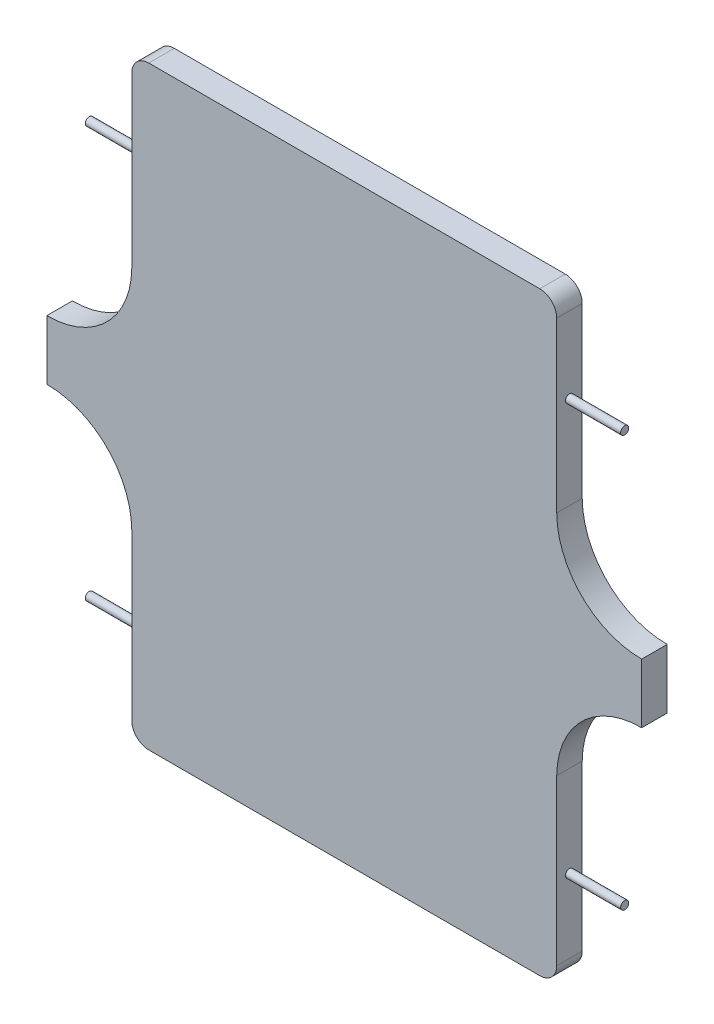
ISO-10303-21;
HEADER;
FILE_DESCRIPTION(('STEP AP214'),'2;1');
FILE_NAME('part.step','',(''),(''),'','','');
FILE_SCHEMA(('AUTOMOTIVE_DESIGN { 1 0 10303 214 1 1 1 1 }'));
ENDSEC;
DATA;
#1=APPLICATION_CONTEXT('core data for automotive mechanical design processes');
#2=APPLICATION_PROTOCOL_DEFINITION('international standard','automotive_design',2000,#1);
#3=PRODUCT_CONTEXT('',#1,'mechanical');
#4=PRODUCT('Part','Part','',(#3));
#5=PRODUCT_RELATED_PRODUCT_CATEGORY('part','',(#4));
#6=PRODUCT_DEFINITION_FORMATION('','',#4);
#7=PRODUCT_DEFINITION_CONTEXT('part definition',#1,'design');
#8=PRODUCT_DEFINITION('design','',#6,#7);
#9=PRODUCT_DEFINITION_SHAPE('','',#8);
#10=(LENGTH_UNIT() NAMED_UNIT(*) SI_UNIT(.MILLI.,.METRE.));
#11=(NAMED_UNIT(*) PLANE_ANGLE_UNIT() SI_UNIT($,.RADIAN.));
#12=(NAMED_UNIT(*) SI_UNIT($,.STERADIAN.) SOLID_ANGLE_UNIT());
#13=UNCERTAINTY_MEASURE_WITH_UNIT(LENGTH_MEASURE(1.E-05),#10,'distance_accuracy_value','');
#14=(GEOMETRIC_REPRESENTATION_CONTEXT(3) GLOBAL_UNCERTAINTY_ASSIGNED_CONTEXT((#13)) GLOBAL_UNIT_ASSIGNED_CONTEXT((#10,
#11,#12)) REPRESENTATION_CONTEXT('',''));
#15=CARTESIAN_POINT('',(0.,0.,0.));
#16=DIRECTION('',(0.,0.,1.));
#17=DIRECTION('',(1.,0.,0.));
#18=AXIS2_PLACEMENT_3D('',#15,#16,#17);
#19=CARTESIAN_POINT('',(-29.4685499797841,-657.74243658485,30.));
#20=DIRECTION('',(0.,0.,1.));
#21=DIRECTION('',(1.,0.,0.));
#22=AXIS2_PLACEMENT_3D('',#19,#20,#21);
#23=CYLINDRICAL_SURFACE('',#22,20.);
#24=DIRECTION('',(0.,0.,1.));
#25=VECTOR('',#24,1.);
#26=CARTESIAN_POINT('',(-49.4685499797841,-657.74243658485,30.));
#27=LINE('',#26,#25);
#28=CARTESIAN_POINT('',(-49.4685499797841,-657.74243658485,0.));
#29=VERTEX_POINT('',#28);
#30=CARTESIAN_POINT('',(-49.4685499797841,-657.74243658485,30.));
#31=VERTEX_POINT('',#30);
#32=EDGE_CURVE('E275',#29,#31,#27,.T.);
#33=ORIENTED_EDGE('',*,*,#32,.F.);
#34=CARTESIAN_POINT('',(-29.4685499797841,-657.74243658485,0.));
#35=DIRECTION('',(0.,0.,1.));
#36=DIRECTION('',(1.,0.,0.));
#37=AXIS2_PLACEMENT_3D('',#34,#35,#36);
#38=CIRCLE('',#37,20.);
#39=CARTESIAN_POINT('',(-29.4685499797841,-677.74243658485,0.));
#40=VERTEX_POINT('',#39);
#41=EDGE_CURVE('E50',#40,#29,#38,.F.);
#42=ORIENTED_EDGE('',*,*,#41,.F.);
#43=DIRECTION('',(0.,0.,1.));
#44=VECTOR('',#43,1.);
#45=CARTESIAN_POINT('',(-29.4685499797841,-677.74243658485,30.));
#46=LINE('',#45,#44);
#47=CARTESIAN_POINT('',(-29.4685499797841,-677.74243658485,30.));
#48=VERTEX_POINT('',#47);
#49=EDGE_CURVE('E278',#48,#40,#46,.F.);
#50=ORIENTED_EDGE('',*,*,#49,.F.);
#51=CARTESIAN_POINT('',(-29.4685499797841,-657.74243658485,30.));
#52=DIRECTION('',(0.,0.,1.));
#53=DIRECTION('',(1.,0.,0.));
#54=AXIS2_PLACEMENT_3D('',#51,#52,#53);
#55=CIRCLE('',#54,20.);
#56=EDGE_CURVE('E12',#31,#48,#55,.T.);
#57=ORIENTED_EDGE('',*,*,#56,.F.);
#58=EDGE_LOOP('',(#33,#42,#50,#57));
#59=FACE_BOUND('',#58,.T.);
#60=ADVANCED_FACE('F43',(#59),#23,.T.);
#61=CARTESIAN_POINT('',(430.531450020216,-657.74243658485,30.));
#62=DIRECTION('',(0.,0.,1.));
#63=DIRECTION('',(1.,0.,0.));
#64=AXIS2_PLACEMENT_3D('',#61,#62,#63);
#65=CYLINDRICAL_SURFACE('',#64,20.);
#66=DIRECTION('',(0.,0.,-1.));
#67=VECTOR('',#66,1.);
#68=CARTESIAN_POINT('',(450.531450020216,-657.74243658485,30.));
#69=LINE('',#68,#67);
#70=CARTESIAN_POINT('',(450.531450020216,-657.74243658485,30.));
#71=VERTEX_POINT('',#70);
#72=CARTESIAN_POINT('',(450.531450020216,-657.74243658485,0.));
#73=VERTEX_POINT('',#72);
#74=EDGE_CURVE('E264',#71,#73,#69,.T.);
#75=ORIENTED_EDGE('',*,*,#74,.F.);
#76=CARTESIAN_POINT('',(430.531450020216,-657.74243658485,30.));
#77=DIRECTION('',(0.,0.,1.));
#78=DIRECTION('',(1.,0.,0.));
#79=AXIS2_PLACEMENT_3D('',#76,#77,#78);
#80=CIRCLE('',#79,20.);
#81=CARTESIAN_POINT('',(430.531450020216,-677.74243658485,30.));
#82=VERTEX_POINT('',#81);
#83=EDGE_CURVE('E270',#82,#71,#80,.T.);
#84=ORIENTED_EDGE('',*,*,#83,.F.);
#85=DIRECTION('',(0.,0.,-1.));
#86=VECTOR('',#85,1.);
#87=CARTESIAN_POINT('',(430.531450020216,-677.74243658485,30.));
#88=LINE('',#87,#86);
#89=CARTESIAN_POINT('',(430.531450020216,-677.74243658485,0.));
#90=VERTEX_POINT('',#89);
#91=EDGE_CURVE('E267',#90,#82,#88,.F.);
#92=ORIENTED_EDGE('',*,*,#91,.F.);
#93=CARTESIAN_POINT('',(430.531450020216,-657.74243658485,0.));
#94=DIRECTION('',(0.,0.,1.));
#95=DIRECTION('',(1.,0.,0.));
#96=AXIS2_PLACEMENT_3D('',#93,#94,#95);
#97=CIRCLE('',#96,20.);
#98=EDGE_CURVE('E272',#73,#90,#97,.F.);
#99=ORIENTED_EDGE('',*,*,#98,.F.);
#100=EDGE_LOOP('',(#75,#84,#92,#99));
#101=FACE_BOUND('',#100,.T.);
#102=ADVANCED_FACE('F302',(#101),#65,.T.);
#103=CARTESIAN_POINT('',(430.531450020216,2.25756341514968,30.));
#104=DIRECTION('',(0.,0.,1.));
#105=DIRECTION('',(1.,0.,0.));
#106=AXIS2_PLACEMENT_3D('',#103,#104,#105);
#107=CYLINDRICAL_SURFACE('',#106,20.);
#108=DIRECTION('',(0.,0.,1.));
#109=VECTOR('',#108,1.);
#110=CARTESIAN_POINT('',(450.531450020216,2.25756341514968,30.));
#111=LINE('',#110,#109);
#112=CARTESIAN_POINT('',(450.531450020216,2.25756341514968,0.));
#113=VERTEX_POINT('',#112);
#114=CARTESIAN_POINT('',(450.531450020216,2.25756341514968,30.));
#115=VERTEX_POINT('',#114);
#116=EDGE_CURVE('E254',#113,#115,#111,.T.);
#117=ORIENTED_EDGE('',*,*,#116,.F.);
#118=CARTESIAN_POINT('',(430.531450020216,2.25756341514968,0.));
#119=DIRECTION('',(0.,0.,1.));
#120=DIRECTION('',(1.,0.,0.));
#121=AXIS2_PLACEMENT_3D('',#118,#119,#120);
#122=CIRCLE('',#121,20.);
#123=CARTESIAN_POINT('',(430.531450020216,22.2575634151497,0.));
#124=VERTEX_POINT('',#123);
#125=EDGE_CURVE('E260',#124,#113,#122,.F.);
#126=ORIENTED_EDGE('',*,*,#125,.F.);
#127=DIRECTION('',(0.,0.,1.));
#128=VECTOR('',#127,1.);
#129=CARTESIAN_POINT('',(430.531450020216,22.2575634151497,30.));
#130=LINE('',#129,#128);
#131=CARTESIAN_POINT('',(430.531450020216,22.2575634151497,30.));
#132=VERTEX_POINT('',#131);
#133=EDGE_CURVE('E257',#132,#124,#130,.F.);
#134=ORIENTED_EDGE('',*,*,#133,.F.);
#135=CARTESIAN_POINT('',(430.531450020216,2.25756341514968,30.));
#136=DIRECTION('',(0.,0.,1.));
#137=DIRECTION('',(1.,0.,0.));
#138=AXIS2_PLACEMENT_3D('',#135,#136,#137);
#139=CIRCLE('',#138,20.);
#140=EDGE_CURVE('E262',#115,#132,#139,.T.);
#141=ORIENTED_EDGE('',*,*,#140,.F.);
#142=EDGE_LOOP('',(#117,#126,#134,#141));
#143=FACE_BOUND('',#142,.T.);
#144=ADVANCED_FACE('F306',(#143),#107,.T.);
#145=CARTESIAN_POINT('',(-29.4685499797842,2.25756341514968,30.));
#146=DIRECTION('',(0.,0.,1.));
#147=DIRECTION('',(1.,0.,0.));
#148=AXIS2_PLACEMENT_3D('',#145,#146,#147);
#149=CYLINDRICAL_SURFACE('',#148,20.);
#150=DIRECTION('',(0.,0.,-1.));
#151=VECTOR('',#150,1.);
#152=CARTESIAN_POINT('',(-49.4685499797842,2.25756341514967,30.));
#153=LINE('',#152,#151);
#154=CARTESIAN_POINT('',(-49.4685499797842,2.25756341514967,30.));
#155=VERTEX_POINT('',#154);
#156=CARTESIAN_POINT('',(-49.4685499797842,2.25756341514967,0.));
#157=VERTEX_POINT('',#156);
#158=EDGE_CURVE('E172',#155,#157,#153,.T.);
#159=ORIENTED_EDGE('',*,*,#158,.F.);
#160=CARTESIAN_POINT('',(-29.4685499797842,2.25756341514968,30.));
#161=DIRECTION('',(0.,0.,1.));
#162=DIRECTION('',(1.,0.,0.));
#163=AXIS2_PLACEMENT_3D('',#160,#161,#162);
#164=CIRCLE('',#163,20.);
#165=CARTESIAN_POINT('',(-29.4685499797842,22.2575634151497,30.));
#166=VERTEX_POINT('',#165);
#167=EDGE_CURVE('E158',#166,#155,#164,.T.);
#168=ORIENTED_EDGE('',*,*,#167,.F.);
#169=DIRECTION('',(0.,0.,-1.));
#170=VECTOR('',#169,1.);
#171=CARTESIAN_POINT('',(-29.4685499797842,22.2575634151497,30.));
#172=LINE('',#171,#170);
#173=CARTESIAN_POINT('',(-29.4685499797842,22.2575634151497,0.));
#174=VERTEX_POINT('',#173);
#175=EDGE_CURVE('E248',#174,#166,#172,.F.);
#176=ORIENTED_EDGE('',*,*,#175,.F.);
#177=CARTESIAN_POINT('',(-29.4685499797842,2.25756341514968,0.));
#178=DIRECTION('',(0.,0.,1.));
#179=DIRECTION('',(1.,0.,0.));
#180=AXIS2_PLACEMENT_3D('',#177,#178,#179);
#181=CIRCLE('',#180,20.);
#182=EDGE_CURVE('E252',#157,#174,#181,.F.);
#183=ORIENTED_EDGE('',*,*,#182,.F.);
#184=EDGE_LOOP('',(#159,#168,#176,#183));
#185=FACE_BOUND('',#184,.T.);
#186=ADVANCED_FACE('F311',(#185),#149,.T.);
#187=CARTESIAN_POINT('',(0.,22.2575634151497,30.));
#188=DIRECTION('',(0.,1.,0.));
#189=DIRECTION('',(0.,0.,1.));
#190=AXIS2_PLACEMENT_3D('',#187,#188,#189);
#191=PLANE('',#190);
#192=DIRECTION('',(1.,0.,0.));
#193=VECTOR('',#192,1.);
#194=CARTESIAN_POINT('',(0.,22.2575634151497,30.));
#195=LINE('',#194,#193);
#196=EDGE_CURVE('E162',#166,#132,#195,.T.);
#197=ORIENTED_EDGE('',*,*,#196,.T.);
#198=ORIENTED_EDGE('',*,*,#133,.T.);
#199=DIRECTION('',(1.,0.,0.));
#200=VECTOR('',#199,1.);
#201=CARTESIAN_POINT('',(0.,22.2575634151497,0.));
#202=LINE('',#201,#200);
#203=EDGE_CURVE('E202',#174,#124,#202,.T.);
#204=ORIENTED_EDGE('',*,*,#203,.F.);
#205=ORIENTED_EDGE('',*,*,#175,.T.);
#206=EDGE_LOOP('',(#197,#198,#204,#205));
#207=FACE_BOUND('',#206,.T.);
#208=ADVANCED_FACE('F318',(#207),#191,.T.);
#209=CARTESIAN_POINT('',(-49.4685499797842,0.,30.));
#210=DIRECTION('',(1.,0.,0.));
#211=DIRECTION('',(0.,1.,0.));
#212=AXIS2_PLACEMENT_3D('',#209,#210,#211);
#213=PLANE('',#212);
#214=CARTESIAN_POINT('',(-49.4685499797842,-87.0236865848503,15.));
#215=DIRECTION('',(1.,0.,0.));
#216=DIRECTION('',(0.,0.,-1.));
#217=AXIS2_PLACEMENT_3D('',#214,#215,#216);
#218=CIRCLE('',#217,4.75000000000001);
#219=CARTESIAN_POINT('',(-49.4685499797842,-87.0236865848503,10.25));
#220=VERTEX_POINT('',#219);
#221=EDGE_CURVE('E205',#220,#220,#218,.T.);
#222=ORIENTED_EDGE('',*,*,#221,.T.);
#223=EDGE_LOOP('',(#222));
#224=FACE_BOUND('',#223,.T.);
#225=DIRECTION('',(0.,-1.,0.));
#226=VECTOR('',#225,1.);
#227=CARTESIAN_POINT('',(-49.4685499797842,0.,30.));
#228=LINE('',#227,#226);
#229=CARTESIAN_POINT('',(-49.4685499797842,-196.30493658485,30.));
#230=VERTEX_POINT('',#229);
#231=EDGE_CURVE('E150',#155,#230,#228,.T.);
#232=ORIENTED_EDGE('',*,*,#231,.F.);
#233=ORIENTED_EDGE('',*,*,#158,.T.);
#234=DIRECTION('',(0.,-1.,0.));
#235=VECTOR('',#234,1.);
#236=CARTESIAN_POINT('',(-49.4685499797842,0.,0.));
#237=LINE('',#236,#235);
#238=CARTESIAN_POINT('',(-49.4685499797842,-196.30493658485,0.));
#239=VERTEX_POINT('',#238);
#240=EDGE_CURVE('E168',#157,#239,#237,.T.);
#241=ORIENTED_EDGE('',*,*,#240,.T.);
#242=DIRECTION('',(0.,0.,-1.));
#243=VECTOR('',#242,1.);
#244=CARTESIAN_POINT('',(-49.4685499797842,-196.30493658485,30.));
#245=LINE('',#244,#243);
#246=EDGE_CURVE('E165',#230,#239,#245,.T.);
#247=ORIENTED_EDGE('',*,*,#246,.F.);
#248=EDGE_LOOP('',(#232,#233,#241,#247));
#249=FACE_BOUND('',#248,.T.);
#250=ADVANCED_FACE('F166',(#224,#249),#213,.F.);
#251=CARTESIAN_POINT('',(-148.874799979785,-195.71118658485,30.));
#252=DIRECTION('',(0.,0.,-1.));
#253=DIRECTION('',(-1.,0.,0.));
#254=AXIS2_PLACEMENT_3D('',#251,#252,#253);
#255=CYLINDRICAL_SURFACE('',#254,99.4080232080142);
#256=CARTESIAN_POINT('',(-148.874799979785,-195.71118658485,0.));
#257=DIRECTION('',(0.,0.,1.));
#258=DIRECTION('',(1.,0.,0.));
#259=AXIS2_PLACEMENT_3D('',#256,#257,#258);
#260=CIRCLE('',#259,99.4080232080142);
#261=CARTESIAN_POINT('',(-149.468549979784,-295.11743658485,0.));
#262=VERTEX_POINT('',#261);
#263=EDGE_CURVE('E207',#239,#262,#260,.F.);
#264=ORIENTED_EDGE('',*,*,#263,.T.);
#265=DIRECTION('',(0.,0.,-1.));
#266=VECTOR('',#265,1.);
#267=CARTESIAN_POINT('',(-149.468549979784,-295.11743658485,30.));
#268=LINE('',#267,#266);
#269=CARTESIAN_POINT('',(-149.468549979784,-295.11743658485,30.));
#270=VERTEX_POINT('',#269);
#271=EDGE_CURVE('E173',#270,#262,#268,.T.);
#272=ORIENTED_EDGE('',*,*,#271,.F.);
#273=CARTESIAN_POINT('',(-148.874799979785,-195.71118658485,30.));
#274=DIRECTION('',(0.,0.,1.));
#275=DIRECTION('',(1.,0.,0.));
#276=AXIS2_PLACEMENT_3D('',#273,#274,#275);
#277=CIRCLE('',#276,99.4080232080142);
#278=EDGE_CURVE('E155',#230,#270,#277,.F.);
#279=ORIENTED_EDGE('',*,*,#278,.F.);
#280=ORIENTED_EDGE('',*,*,#246,.T.);
#281=EDGE_LOOP('',(#264,#272,#279,#280));
#282=FACE_BOUND('',#281,.T.);
#283=ADVANCED_FACE('F175',(#282),#255,.F.);
#284=CARTESIAN_POINT('',(-149.468549979784,0.,30.));
#285=DIRECTION('',(-1.,0.,0.));
#286=DIRECTION('',(0.,0.,1.));
#287=AXIS2_PLACEMENT_3D('',#284,#285,#286);
#288=PLANE('',#287);
#289=DIRECTION('',(0.,1.,0.));
#290=VECTOR('',#289,1.);
#291=CARTESIAN_POINT('',(-149.468549979784,0.,0.));
#292=LINE('',#291,#290);
#293=CARTESIAN_POINT('',(-149.468549979784,-365.11743658485,0.));
#294=VERTEX_POINT('',#293);
#295=EDGE_CURVE('E209',#294,#262,#292,.T.);
#296=ORIENTED_EDGE('',*,*,#295,.F.);
#297=DIRECTION('',(0.,0.,-1.));
#298=VECTOR('',#297,1.);
#299=CARTESIAN_POINT('',(-149.468549979784,-365.11743658485,30.));
#300=LINE('',#299,#298);
#301=CARTESIAN_POINT('',(-149.468549979784,-365.11743658485,30.));
#302=VERTEX_POINT('',#301);
#303=EDGE_CURVE('E244',#302,#294,#300,.T.);
#304=ORIENTED_EDGE('',*,*,#303,.F.);
#305=DIRECTION('',(0.,1.,0.));
#306=VECTOR('',#305,1.);
#307=CARTESIAN_POINT('',(-149.468549979784,0.,30.));
#308=LINE('',#307,#306);
#309=EDGE_CURVE('E177',#302,#270,#308,.T.);
#310=ORIENTED_EDGE('',*,*,#309,.T.);
#311=ORIENTED_EDGE('',*,*,#271,.T.);
#312=EDGE_LOOP('',(#296,#304,#310,#311));
#313=FACE_BOUND('',#312,.T.);
#314=ADVANCED_FACE('F292',(#313),#288,.T.);
#315=CARTESIAN_POINT('',(-148.874799979785,-464.523686584851,30.));
#316=DIRECTION('',(0.,0.,-1.));
#317=DIRECTION('',(-1.,0.,0.));
#318=AXIS2_PLACEMENT_3D('',#315,#316,#317);
#319=CYLINDRICAL_SURFACE('',#318,99.4080232080142);
#320=CARTESIAN_POINT('',(-148.874799979785,-464.523686584851,0.));
#321=DIRECTION('',(0.,0.,1.));
#322=DIRECTION('',(1.,0.,0.));
#323=AXIS2_PLACEMENT_3D('',#320,#321,#322);
#324=CIRCLE('',#323,99.4080232080142);
#325=CARTESIAN_POINT('',(-49.4685499797841,-463.92993658485,0.));
#326=VERTEX_POINT('',#325);
#327=EDGE_CURVE('E212',#326,#294,#324,.T.);
#328=ORIENTED_EDGE('',*,*,#327,.F.);
#329=DIRECTION('',(0.,0.,-1.));
#330=VECTOR('',#329,1.);
#331=CARTESIAN_POINT('',(-49.4685499797841,-463.92993658485,30.));
#332=LINE('',#331,#330);
#333=CARTESIAN_POINT('',(-49.4685499797841,-463.92993658485,30.));
#334=VERTEX_POINT('',#333);
#335=EDGE_CURVE('E242',#334,#326,#332,.T.);
#336=ORIENTED_EDGE('',*,*,#335,.F.);
#337=CARTESIAN_POINT('',(-148.874799979785,-464.523686584851,30.));
#338=DIRECTION('',(0.,0.,1.));
#339=DIRECTION('',(1.,0.,0.));
#340=AXIS2_PLACEMENT_3D('',#337,#338,#339);
#341=CIRCLE('',#340,99.4080232080142);
#342=EDGE_CURVE('E179',#334,#302,#341,.T.);
#343=ORIENTED_EDGE('',*,*,#342,.T.);
#344=ORIENTED_EDGE('',*,*,#303,.T.);
#345=EDGE_LOOP('',(#328,#336,#343,#344));
#346=FACE_BOUND('',#345,.T.);
#347=ADVANCED_FACE('F289',(#346),#319,.F.);
#348=CARTESIAN_POINT('',(-49.4685499797842,0.,30.));
#349=DIRECTION('',(1.,0.,0.));
#350=DIRECTION('',(0.,1.,0.));
#351=AXIS2_PLACEMENT_3D('',#348,#349,#350);
#352=PLANE('',#351);
#353=CARTESIAN_POINT('',(-49.4685499797841,-570.83618658485,15.));
#354=DIRECTION('',(1.,0.,0.));
#355=DIRECTION('',(0.,0.,-1.));
#356=AXIS2_PLACEMENT_3D('',#353,#354,#355);
#357=CIRCLE('',#356,4.75000000000005);
#358=CARTESIAN_POINT('',(-49.4685499797841,-570.83618658485,10.25));
#359=VERTEX_POINT('',#358);
#360=EDGE_CURVE('E333',#359,#359,#357,.T.);
#361=ORIENTED_EDGE('',*,*,#360,.T.);
#362=EDGE_LOOP('',(#361));
#363=FACE_BOUND('',#362,.T.);
#364=DIRECTION('',(0.,-1.,0.));
#365=VECTOR('',#364,1.);
#366=CARTESIAN_POINT('',(-49.4685499797842,0.,0.));
#367=LINE('',#366,#365);
#368=EDGE_CURVE('E215',#326,#29,#367,.T.);
#369=ORIENTED_EDGE('',*,*,#368,.T.);
#370=ORIENTED_EDGE('',*,*,#32,.T.);
#371=DIRECTION('',(0.,-1.,0.));
#372=VECTOR('',#371,1.);
#373=CARTESIAN_POINT('',(-49.4685499797842,0.,30.));
#374=LINE('',#373,#372);
#375=EDGE_CURVE('E185',#334,#31,#374,.T.);
#376=ORIENTED_EDGE('',*,*,#375,.F.);
#377=ORIENTED_EDGE('',*,*,#335,.T.);
#378=EDGE_LOOP('',(#369,#370,#376,#377));
#379=FACE_BOUND('',#378,.T.);
#380=ADVANCED_FACE('F286',(#363,#379),#352,.F.);
#381=CARTESIAN_POINT('',(0.,-677.74243658485,30.));
#382=DIRECTION('',(0.,1.,0.));
#383=DIRECTION('',(0.,0.,1.));
#384=AXIS2_PLACEMENT_3D('',#381,#382,#383);
#385=PLANE('',#384);
#386=DIRECTION('',(1.,0.,0.));
#387=VECTOR('',#386,1.);
#388=CARTESIAN_POINT('',(0.,-677.74243658485,30.));
#389=LINE('',#388,#387);
#390=EDGE_CURVE('E187',#48,#82,#389,.T.);
#391=ORIENTED_EDGE('',*,*,#390,.F.);
#392=ORIENTED_EDGE('',*,*,#49,.T.);
#393=DIRECTION('',(1.,0.,0.));
#394=VECTOR('',#393,1.);
#395=CARTESIAN_POINT('',(0.,-677.74243658485,0.));
#396=LINE('',#395,#394);
#397=EDGE_CURVE('E218',#40,#90,#396,.T.);
#398=ORIENTED_EDGE('',*,*,#397,.T.);
#399=ORIENTED_EDGE('',*,*,#91,.T.);
#400=EDGE_LOOP('',(#391,#392,#398,#399));
#401=FACE_BOUND('',#400,.T.);
#402=ADVANCED_FACE('F367',(#401),#385,.F.);
#403=CARTESIAN_POINT('',(450.531450020216,1.16969398218112E-13,30.));
#404=DIRECTION('',(1.,0.,0.));
#405=DIRECTION('',(0.,1.,0.));
#406=AXIS2_PLACEMENT_3D('',#403,#404,#405);
#407=PLANE('',#406);
#408=CARTESIAN_POINT('',(450.531450020216,-570.83618658485,15.));
#409=DIRECTION('',(1.,0.,0.));
#410=DIRECTION('',(0.,0.,-1.));
#411=AXIS2_PLACEMENT_3D('',#408,#409,#410);
#412=CIRCLE('',#411,4.75000000000005);
#413=CARTESIAN_POINT('',(450.531450020216,-570.83618658485,10.25));
#414=VERTEX_POINT('',#413);
#415=EDGE_CURVE('E399',#414,#414,#412,.T.);
#416=ORIENTED_EDGE('',*,*,#415,.F.);
#417=EDGE_LOOP('',(#416));
#418=FACE_BOUND('',#417,.T.);
#419=DIRECTION('',(0.,-1.,0.));
#420=VECTOR('',#419,1.);
#421=CARTESIAN_POINT('',(450.531450020216,1.16969398218112E-13,30.));
#422=LINE('',#421,#420);
#423=CARTESIAN_POINT('',(450.531450020216,-463.92993658485,30.));
#424=VERTEX_POINT('',#423);
#425=EDGE_CURVE('E189',#424,#71,#422,.T.);
#426=ORIENTED_EDGE('',*,*,#425,.T.);
#427=ORIENTED_EDGE('',*,*,#74,.T.);
#428=DIRECTION('',(0.,-1.,0.));
#429=VECTOR('',#428,1.);
#430=CARTESIAN_POINT('',(450.531450020216,1.16969398218112E-13,0.));
#431=LINE('',#430,#429);
#432=CARTESIAN_POINT('',(450.531450020216,-463.92993658485,0.));
#433=VERTEX_POINT('',#432);
#434=EDGE_CURVE('E220',#433,#73,#431,.T.);
#435=ORIENTED_EDGE('',*,*,#434,.F.);
#436=DIRECTION('',(0.,0.,-1.));
#437=VECTOR('',#436,1.);
#438=CARTESIAN_POINT('',(450.531450020216,-463.92993658485,30.));
#439=LINE('',#438,#437);
#440=EDGE_CURVE('E240',#424,#433,#439,.T.);
#441=ORIENTED_EDGE('',*,*,#440,.F.);
#442=EDGE_LOOP('',(#426,#427,#435,#441));
#443=FACE_BOUND('',#442,.T.);
#444=ADVANCED_FACE('F360',(#418,#443),#407,.T.);
#445=CARTESIAN_POINT('',(549.937700020216,-464.523686584851,30.));
#446=DIRECTION('',(0.,0.,-1.));
#447=DIRECTION('',(-1.,0.,0.));
#448=AXIS2_PLACEMENT_3D('',#445,#446,#447);
#449=CYLINDRICAL_SURFACE('',#448,99.4080232080142);
#450=CARTESIAN_POINT('',(549.937700020216,-464.523686584851,0.));
#451=DIRECTION('',(0.,0.,1.));
#452=DIRECTION('',(1.,0.,0.));
#453=AXIS2_PLACEMENT_3D('',#450,#451,#452);
#454=CIRCLE('',#453,99.4080232080142);
#455=CARTESIAN_POINT('',(550.531450020216,-365.11743658485,0.));
#456=VERTEX_POINT('',#455);
#457=EDGE_CURVE('E223',#433,#456,#454,.F.);
#458=ORIENTED_EDGE('',*,*,#457,.T.);
#459=DIRECTION('',(0.,0.,-1.));
#460=VECTOR('',#459,1.);
#461=CARTESIAN_POINT('',(550.531450020216,-365.11743658485,30.));
#462=LINE('',#461,#460);
#463=CARTESIAN_POINT('',(550.531450020216,-365.11743658485,30.));
#464=VERTEX_POINT('',#463);
#465=EDGE_CURVE('E237',#464,#456,#462,.T.);
#466=ORIENTED_EDGE('',*,*,#465,.F.);
#467=CARTESIAN_POINT('',(549.937700020216,-464.523686584851,30.));
#468=DIRECTION('',(0.,0.,1.));
#469=DIRECTION('',(1.,0.,0.));
#470=AXIS2_PLACEMENT_3D('',#467,#468,#469);
#471=CIRCLE('',#470,99.4080232080142);
#472=EDGE_CURVE('E192',#424,#464,#471,.F.);
#473=ORIENTED_EDGE('',*,*,#472,.F.);
#474=ORIENTED_EDGE('',*,*,#440,.T.);
#475=EDGE_LOOP('',(#458,#466,#473,#474));
#476=FACE_BOUND('',#475,.T.);
#477=ADVANCED_FACE('F368',(#476),#449,.F.);
#478=CARTESIAN_POINT('',(550.531450020216,0.,30.));
#479=DIRECTION('',(-1.,0.,0.));
#480=DIRECTION('',(0.,0.,1.));
#481=AXIS2_PLACEMENT_3D('',#478,#479,#480);
#482=PLANE('',#481);
#483=DIRECTION('',(0.,1.,0.));
#484=VECTOR('',#483,1.);
#485=CARTESIAN_POINT('',(550.531450020216,0.,0.));
#486=LINE('',#485,#484);
#487=CARTESIAN_POINT('',(550.531450020216,-295.11743658485,0.));
#488=VERTEX_POINT('',#487);
#489=EDGE_CURVE('E225',#456,#488,#486,.T.);
#490=ORIENTED_EDGE('',*,*,#489,.T.);
#491=DIRECTION('',(0.,0.,-1.));
#492=VECTOR('',#491,1.);
#493=CARTESIAN_POINT('',(550.531450020216,-295.11743658485,30.));
#494=LINE('',#493,#492);
#495=CARTESIAN_POINT('',(550.531450020216,-295.11743658485,30.));
#496=VERTEX_POINT('',#495);
#497=EDGE_CURVE('E235',#496,#488,#494,.T.);
#498=ORIENTED_EDGE('',*,*,#497,.F.);
#499=DIRECTION('',(0.,1.,0.));
#500=VECTOR('',#499,1.);
#501=CARTESIAN_POINT('',(550.531450020216,0.,30.));
#502=LINE('',#501,#500);
#503=EDGE_CURVE('E194',#464,#496,#502,.T.);
#504=ORIENTED_EDGE('',*,*,#503,.F.);
#505=ORIENTED_EDGE('',*,*,#465,.T.);
#506=EDGE_LOOP('',(#490,#498,#504,#505));
#507=FACE_BOUND('',#506,.T.);
#508=ADVANCED_FACE('F354',(#507),#482,.F.);
#509=CARTESIAN_POINT('',(549.937700020216,-195.71118658485,30.));
#510=DIRECTION('',(0.,0.,-1.));
#511=DIRECTION('',(-1.,0.,0.));
#512=AXIS2_PLACEMENT_3D('',#509,#510,#511);
#513=CYLINDRICAL_SURFACE('',#512,99.4080232080142);
#514=CARTESIAN_POINT('',(549.937700020216,-195.71118658485,0.));
#515=DIRECTION('',(0.,0.,1.));
#516=DIRECTION('',(1.,0.,0.));
#517=AXIS2_PLACEMENT_3D('',#514,#515,#516);
#518=CIRCLE('',#517,99.4080232080142);
#519=CARTESIAN_POINT('',(450.531450020216,-196.30493658485,0.));
#520=VERTEX_POINT('',#519);
#521=EDGE_CURVE('E228',#520,#488,#518,.T.);
#522=ORIENTED_EDGE('',*,*,#521,.F.);
#523=DIRECTION('',(0.,0.,-1.));
#524=VECTOR('',#523,1.);
#525=CARTESIAN_POINT('',(450.531450020216,-196.30493658485,30.));
#526=LINE('',#525,#524);
#527=CARTESIAN_POINT('',(450.531450020216,-196.30493658485,30.));
#528=VERTEX_POINT('',#527);
#529=EDGE_CURVE('E201',#528,#520,#526,.T.);
#530=ORIENTED_EDGE('',*,*,#529,.F.);
#531=CARTESIAN_POINT('',(549.937700020216,-195.71118658485,30.));
#532=DIRECTION('',(0.,0.,1.));
#533=DIRECTION('',(1.,0.,0.));
#534=AXIS2_PLACEMENT_3D('',#531,#532,#533);
#535=CIRCLE('',#534,99.4080232080142);
#536=EDGE_CURVE('E196',#528,#496,#535,.T.);
#537=ORIENTED_EDGE('',*,*,#536,.T.);
#538=ORIENTED_EDGE('',*,*,#497,.T.);
#539=EDGE_LOOP('',(#522,#530,#537,#538));
#540=FACE_BOUND('',#539,.T.);
#541=ADVANCED_FACE('F350',(#540),#513,.F.);
#542=CARTESIAN_POINT('',(450.531450020216,0.,30.));
#543=DIRECTION('',(1.,0.,0.));
#544=DIRECTION('',(0.,0.,-1.));
#545=AXIS2_PLACEMENT_3D('',#542,#543,#544);
#546=PLANE('',#545);
#547=CARTESIAN_POINT('',(450.531450020216,-87.0236865848503,15.));
#548=DIRECTION('',(1.,0.,0.));
#549=DIRECTION('',(0.,0.,-1.));
#550=AXIS2_PLACEMENT_3D('',#547,#548,#549);
#551=CIRCLE('',#550,4.75000000000001);
#552=CARTESIAN_POINT('',(450.531450020216,-87.0236865848503,10.25));
#553=VERTEX_POINT('',#552);
#554=EDGE_CURVE('E391',#553,#553,#551,.T.);
#555=ORIENTED_EDGE('',*,*,#554,.F.);
#556=EDGE_LOOP('',(#555));
#557=FACE_BOUND('',#556,.T.);
#558=DIRECTION('',(0.,-1.,0.));
#559=VECTOR('',#558,1.);
#560=CARTESIAN_POINT('',(450.531450020216,0.,0.));
#561=LINE('',#560,#559);
#562=EDGE_CURVE('E231',#113,#520,#561,.T.);
#563=ORIENTED_EDGE('',*,*,#562,.F.);
#564=ORIENTED_EDGE('',*,*,#116,.T.);
#565=DIRECTION('',(0.,-1.,0.));
#566=VECTOR('',#565,1.);
#567=CARTESIAN_POINT('',(450.531450020216,0.,30.));
#568=LINE('',#567,#566);
#569=EDGE_CURVE('E199',#115,#528,#568,.T.);
#570=ORIENTED_EDGE('',*,*,#569,.T.);
#571=ORIENTED_EDGE('',*,*,#529,.T.);
#572=EDGE_LOOP('',(#563,#564,#570,#571));
#573=FACE_BOUND('',#572,.T.);
#574=ADVANCED_FACE('F348',(#557,#573),#546,.T.);
#575=CARTESIAN_POINT('',(0.,0.,30.));
#576=DIRECTION('',(0.,0.,1.));
#577=DIRECTION('',(1.,0.,0.));
#578=AXIS2_PLACEMENT_3D('',#575,#576,#577);
#579=PLANE('',#578);
#580=ORIENTED_EDGE('',*,*,#375,.T.);
#581=ORIENTED_EDGE('',*,*,#56,.T.);
#582=ORIENTED_EDGE('',*,*,#390,.T.);
#583=ORIENTED_EDGE('',*,*,#83,.T.);
#584=ORIENTED_EDGE('',*,*,#425,.F.);
#585=ORIENTED_EDGE('',*,*,#472,.T.);
#586=ORIENTED_EDGE('',*,*,#503,.T.);
#587=ORIENTED_EDGE('',*,*,#536,.F.);
#588=ORIENTED_EDGE('',*,*,#569,.F.);
#589=ORIENTED_EDGE('',*,*,#140,.T.);
#590=ORIENTED_EDGE('',*,*,#196,.F.);
#591=ORIENTED_EDGE('',*,*,#167,.T.);
#592=ORIENTED_EDGE('',*,*,#231,.T.);
#593=ORIENTED_EDGE('',*,*,#278,.T.);
#594=ORIENTED_EDGE('',*,*,#309,.F.);
#595=ORIENTED_EDGE('',*,*,#342,.F.);
#596=EDGE_LOOP('',(#580,#581,#582,#583,#584,#585,#586,#587,#588,#589,#590,#591,#592,#593,#594,#595));
#597=FACE_BOUND('',#596,.T.);
#598=ADVANCED_FACE('F152',(#597),#579,.T.);
#599=CARTESIAN_POINT('',(0.,0.,0.));
#600=DIRECTION('',(0.,0.,1.));
#601=DIRECTION('',(1.,0.,0.));
#602=AXIS2_PLACEMENT_3D('',#599,#600,#601);
#603=PLANE('',#602);
#604=ORIENTED_EDGE('',*,*,#397,.F.);
#605=ORIENTED_EDGE('',*,*,#41,.T.);
#606=ORIENTED_EDGE('',*,*,#368,.F.);
#607=ORIENTED_EDGE('',*,*,#327,.T.);
#608=ORIENTED_EDGE('',*,*,#295,.T.);
#609=ORIENTED_EDGE('',*,*,#263,.F.);
#610=ORIENTED_EDGE('',*,*,#240,.F.);
#611=ORIENTED_EDGE('',*,*,#182,.T.);
#612=ORIENTED_EDGE('',*,*,#203,.T.);
#613=ORIENTED_EDGE('',*,*,#125,.T.);
#614=ORIENTED_EDGE('',*,*,#562,.T.);
#615=ORIENTED_EDGE('',*,*,#521,.T.);
#616=ORIENTED_EDGE('',*,*,#489,.F.);
#617=ORIENTED_EDGE('',*,*,#457,.F.);
#618=ORIENTED_EDGE('',*,*,#434,.T.);
#619=ORIENTED_EDGE('',*,*,#98,.T.);
#620=EDGE_LOOP('',(#604,#605,#606,#607,#608,#609,#610,#611,#612,#613,#614,#615,#616,#617,#618,#619));
#621=FACE_BOUND('',#620,.T.);
#622=ADVANCED_FACE('F282',(#621),#603,.F.);
#623=CARTESIAN_POINT('',(-114.468549979784,4.00756770391987E-13,0.));
#624=DIRECTION('',(1.,0.,0.));
#625=DIRECTION('',(0.,1.,0.));
#626=AXIS2_PLACEMENT_3D('',#623,#624,#625);
#627=PLANE('',#626);
#628=CARTESIAN_POINT('',(-114.468549979784,-87.0236865848503,15.));
#629=DIRECTION('',(1.,0.,0.));
#630=DIRECTION('',(0.,0.,-1.));
#631=AXIS2_PLACEMENT_3D('',#628,#629,#630);
#632=CIRCLE('',#631,4.75000000000001);
#633=CARTESIAN_POINT('',(-114.468549979784,-87.0236865848503,10.25));
#634=VERTEX_POINT('',#633);
#635=EDGE_CURVE('E330',#634,#634,#632,.T.);
#636=ORIENTED_EDGE('',*,*,#635,.F.);
#637=EDGE_LOOP('',(#636));
#638=FACE_BOUND('',#637,.T.);
#639=ADVANCED_FACE('F432',(#638),#627,.F.);
#640=CARTESIAN_POINT('',(-114.468549979784,-87.0236865848503,15.));
#641=DIRECTION('',(1.,0.,0.));
#642=DIRECTION('',(0.,1.,0.));
#643=AXIS2_PLACEMENT_3D('',#640,#641,#642);
#644=CYLINDRICAL_SURFACE('',#643,4.75000000000001);
#645=ORIENTED_EDGE('',*,*,#635,.T.);
#646=EDGE_LOOP('',(#645));
#647=FACE_BOUND('',#646,.T.);
#648=ORIENTED_EDGE('',*,*,#221,.F.);
#649=EDGE_LOOP('',(#648));
#650=FACE_BOUND('',#649,.T.);
#651=ADVANCED_FACE('F436',(#647,#650),#644,.T.);
#652=CARTESIAN_POINT('',(-114.468549979784,0.,3.33963975326654E-13));
#653=DIRECTION('',(1.,0.,0.));
#654=DIRECTION('',(0.,0.,-1.));
#655=AXIS2_PLACEMENT_3D('',#652,#653,#654);
#656=PLANE('',#655);
#657=CARTESIAN_POINT('',(-114.468549979784,-570.83618658485,15.));
#658=DIRECTION('',(1.,0.,0.));
#659=DIRECTION('',(0.,0.,-1.));
#660=AXIS2_PLACEMENT_3D('',#657,#658,#659);
#661=CIRCLE('',#660,4.75000000000005);
#662=CARTESIAN_POINT('',(-114.468549979784,-570.83618658485,10.25));
#663=VERTEX_POINT('',#662);
#664=EDGE_CURVE('E389',#663,#663,#661,.T.);
#665=ORIENTED_EDGE('',*,*,#664,.F.);
#666=EDGE_LOOP('',(#665));
#667=FACE_BOUND('',#666,.T.);
#668=ADVANCED_FACE('F429',(#667),#656,.F.);
#669=CARTESIAN_POINT('',(-114.468549979784,-570.83618658485,15.));
#670=DIRECTION('',(1.,0.,0.));
#671=DIRECTION('',(0.,1.,0.));
#672=AXIS2_PLACEMENT_3D('',#669,#670,#671);
#673=CYLINDRICAL_SURFACE('',#672,4.75000000000005);
#674=ORIENTED_EDGE('',*,*,#664,.T.);
#675=EDGE_LOOP('',(#674));
#676=FACE_BOUND('',#675,.T.);
#677=ORIENTED_EDGE('',*,*,#360,.F.);
#678=EDGE_LOOP('',(#677));
#679=FACE_BOUND('',#678,.T.);
#680=ADVANCED_FACE('F420',(#676,#679),#673,.T.);
#681=CARTESIAN_POINT('',(515.531450020217,-1.2032575409408E-11,-4.81303016376318E-12));
#682=DIRECTION('',(-1.,0.,0.));
#683=DIRECTION('',(0.,-1.,0.));
#684=AXIS2_PLACEMENT_3D('',#681,#682,#683);
#685=PLANE('',#684);
#686=CARTESIAN_POINT('',(515.531450020216,-87.0236865848503,15.));
#687=DIRECTION('',(1.,0.,0.));
#688=DIRECTION('',(0.,0.,-1.));
#689=AXIS2_PLACEMENT_3D('',#686,#687,#688);
#690=CIRCLE('',#689,4.75000000000001);
#691=CARTESIAN_POINT('',(515.531450020216,-87.0236865848503,10.25));
#692=VERTEX_POINT('',#691);
#693=EDGE_CURVE('E396',#692,#692,#690,.T.);
#694=ORIENTED_EDGE('',*,*,#693,.T.);
#695=EDGE_LOOP('',(#694));
#696=FACE_BOUND('',#695,.T.);
#697=ADVANCED_FACE('F412',(#696),#685,.F.);
#698=CARTESIAN_POINT('',(515.531450020216,-87.0236865848503,15.));
#699=DIRECTION('',(-1.,0.,0.));
#700=DIRECTION('',(0.,0.,1.));
#701=AXIS2_PLACEMENT_3D('',#698,#699,#700);
#702=CYLINDRICAL_SURFACE('',#701,4.75000000000001);
#703=ORIENTED_EDGE('',*,*,#693,.F.);
#704=EDGE_LOOP('',(#703));
#705=FACE_BOUND('',#704,.T.);
#706=ORIENTED_EDGE('',*,*,#554,.T.);
#707=EDGE_LOOP('',(#706));
#708=FACE_BOUND('',#707,.T.);
#709=ADVANCED_FACE('F417',(#705,#708),#702,.T.);
#710=CARTESIAN_POINT('',(515.531450020224,-7.21954524564484E-12,1.20325754094081E-11));
#711=DIRECTION('',(-1.,0.,0.));
#712=DIRECTION('',(0.,0.,1.));
#713=AXIS2_PLACEMENT_3D('',#710,#711,#712);
#714=PLANE('',#713);
#715=CARTESIAN_POINT('',(515.531450020216,-570.83618658485,15.));
#716=DIRECTION('',(1.,0.,0.));
#717=DIRECTION('',(0.,0.,-1.));
#718=AXIS2_PLACEMENT_3D('',#715,#716,#717);
#719=CIRCLE('',#718,4.75000000000005);
#720=CARTESIAN_POINT('',(515.531450020216,-570.83618658485,10.25));
#721=VERTEX_POINT('',#720);
#722=EDGE_CURVE('E402',#721,#721,#719,.T.);
#723=ORIENTED_EDGE('',*,*,#722,.T.);
#724=EDGE_LOOP('',(#723));
#725=FACE_BOUND('',#724,.T.);
#726=ADVANCED_FACE('F406',(#725),#714,.F.);
#727=CARTESIAN_POINT('',(515.531450020216,-570.83618658485,15.));
#728=DIRECTION('',(-1.,0.,0.));
#729=DIRECTION('',(0.,0.,1.));
#730=AXIS2_PLACEMENT_3D('',#727,#728,#729);
#731=CYLINDRICAL_SURFACE('',#730,4.75000000000005);
#732=ORIENTED_EDGE('',*,*,#722,.F.);
#733=EDGE_LOOP('',(#732));
#734=FACE_BOUND('',#733,.T.);
#735=ORIENTED_EDGE('',*,*,#415,.T.);
#736=EDGE_LOOP('',(#735));
#737=FACE_BOUND('',#736,.T.);
#738=ADVANCED_FACE('F408',(#734,#737),#731,.T.);
#739=CLOSED_SHELL('',(#60,#102,#144,#186,#208,#250,#283,#314,#347,#380,#402,#444,#477,#508,#541,
#574,#598,#622,#639,#651,#668,#680,#697,#709,#726,#738));
#740=MANIFOLD_SOLID_BREP('B2',#739);
#741=ADVANCED_BREP_SHAPE_REPRESENTATION('',(#18,#740),#14);
#742=SHAPE_DEFINITION_REPRESENTATION(#9,#741);
ENDSEC;
END-ISO-10303-21;
